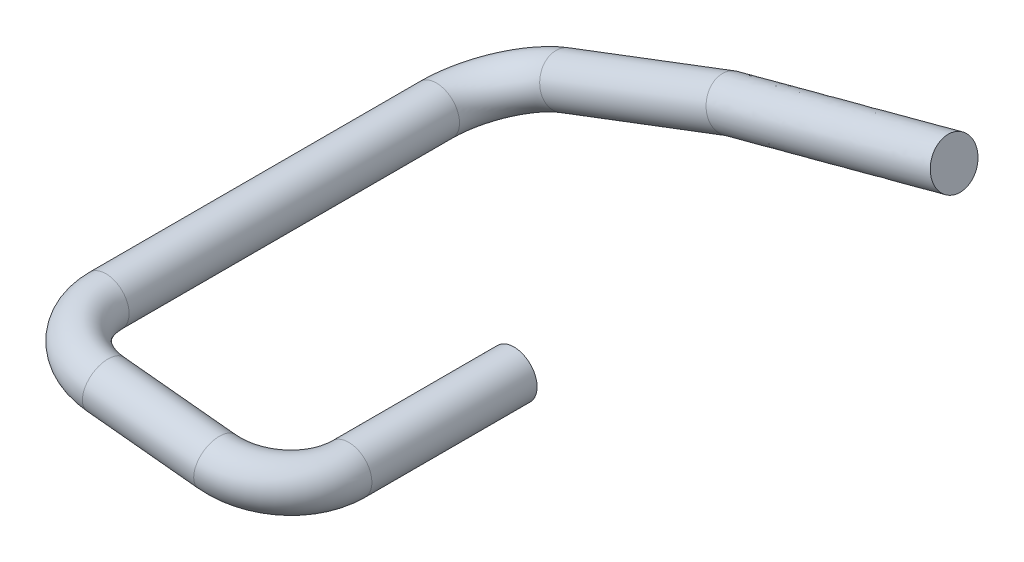
ISO-10303-21;
HEADER;
FILE_DESCRIPTION(('STEP AP214'),'2;1');
FILE_NAME('part.step','',(''),(''),'','','');
FILE_SCHEMA(('AUTOMOTIVE_DESIGN { 1 0 10303 214 1 1 1 1 }'));
ENDSEC;
DATA;
#1=APPLICATION_CONTEXT('core data for automotive mechanical design processes');
#2=APPLICATION_PROTOCOL_DEFINITION('international standard','automotive_design',2000,#1);
#3=PRODUCT_CONTEXT('',#1,'mechanical');
#4=PRODUCT('Part','Part','',(#3));
#5=PRODUCT_RELATED_PRODUCT_CATEGORY('part','',(#4));
#6=PRODUCT_DEFINITION_FORMATION('','',#4);
#7=PRODUCT_DEFINITION_CONTEXT('part definition',#1,'design');
#8=PRODUCT_DEFINITION('design','',#6,#7);
#9=PRODUCT_DEFINITION_SHAPE('','',#8);
#10=(LENGTH_UNIT() NAMED_UNIT(*) SI_UNIT(.MILLI.,.METRE.));
#11=(NAMED_UNIT(*) PLANE_ANGLE_UNIT() SI_UNIT($,.RADIAN.));
#12=(NAMED_UNIT(*) SI_UNIT($,.STERADIAN.) SOLID_ANGLE_UNIT());
#13=UNCERTAINTY_MEASURE_WITH_UNIT(LENGTH_MEASURE(1.E-05),#10,'distance_accuracy_value','');
#14=(GEOMETRIC_REPRESENTATION_CONTEXT(3) GLOBAL_UNCERTAINTY_ASSIGNED_CONTEXT((#13)) GLOBAL_UNIT_ASSIGNED_CONTEXT((#10,
#11,#12)) REPRESENTATION_CONTEXT('',''));
#15=CARTESIAN_POINT('',(0.,0.,0.));
#16=DIRECTION('',(0.,0.,1.));
#17=DIRECTION('',(1.,0.,0.));
#18=AXIS2_PLACEMENT_3D('',#15,#16,#17);
#19=CARTESIAN_POINT('',(6.5,0.,0.));
#20=DIRECTION('',(0.,0.,-1.));
#21=DIRECTION('',(0.,-1.,0.));
#22=AXIS2_PLACEMENT_3D('',#19,#20,#21);
#23=PLANE('',#22);
#24=CARTESIAN_POINT('',(6.5,0.,0.));
#25=DIRECTION('',(0.,0.,-1.));
#26=DIRECTION('',(-0.97970833772415,0.200428473510582,0.));
#27=AXIS2_PLACEMENT_3D('',#24,#25,#26);
#28=CIRCLE('',#27,0.35);
#29=CARTESIAN_POINT('',(6.84289791820345,-0.070149965728704,0.));
#30=VERTEX_POINT('',#29);
#31=EDGE_CURVE('E136',#30,#30,#28,.T.);
#32=ORIENTED_EDGE('',*,*,#31,.T.);
#33=EDGE_LOOP('',(#32));
#34=FACE_BOUND('',#33,.T.);
#35=ADVANCED_FACE('F17',(#34),#23,.T.);
#36=CARTESIAN_POINT('',(2.82561785491536,0.371999647827147,0.));
#37=DIRECTION('',(0.,0.,1.));
#38=DIRECTION('',(1.,0.,0.));
#39=AXIS2_PLACEMENT_3D('',#36,#37,#38);
#40=CYLINDRICAL_SURFACE('',#39,0.35);
#41=CARTESIAN_POINT('',(2.82561785491536,0.371999647827147,2.5));
#42=DIRECTION('',(0.,0.,1.));
#43=DIRECTION('',(1.,0.,0.));
#44=AXIS2_PLACEMENT_3D('',#41,#42,#43);
#45=CIRCLE('',#44,0.35);
#46=CARTESIAN_POINT('',(2.47561785491536,0.371999647827147,2.5));
#47=VERTEX_POINT('',#46);
#48=CARTESIAN_POINT('',(3.17383780794161,0.33674536703182,2.5));
#49=VERTEX_POINT('',#48);
#50=EDGE_CURVE('E25',#47,#49,#45,.T.);
#51=ORIENTED_EDGE('',*,*,#50,.F.);
#52=DIRECTION('',(0.,0.,-1.));
#53=VECTOR('',#52,1.);
#54=CARTESIAN_POINT('',(2.47561785491536,0.371999647827147,0.));
#55=LINE('',#54,#53);
#56=CARTESIAN_POINT('',(2.47561785491536,0.371999647827147,-2.5));
#57=VERTEX_POINT('',#56);
#58=EDGE_CURVE('E11',#47,#57,#55,.T.);
#59=ORIENTED_EDGE('',*,*,#58,.T.);
#60=CARTESIAN_POINT('',(2.82561785491536,0.371999647827147,-2.5));
#61=DIRECTION('',(0.,0.,-1.));
#62=DIRECTION('',(1.,0.,0.));
#63=AXIS2_PLACEMENT_3D('',#60,#61,#62);
#64=CIRCLE('',#63,0.35);
#65=CARTESIAN_POINT('',(3.15284802148136,0.496178623862499,-2.5));
#66=VERTEX_POINT('',#65);
#67=EDGE_CURVE('E158',#66,#57,#64,.T.);
#68=ORIENTED_EDGE('',*,*,#67,.F.);
#69=CARTESIAN_POINT('',(2.82561785491536,0.371999647827147,-2.5));
#70=DIRECTION('',(0.,0.,-1.));
#71=DIRECTION('',(1.,0.,0.));
#72=AXIS2_PLACEMENT_3D('',#69,#70,#71);
#73=CIRCLE('',#72,0.35);
#74=EDGE_CURVE('E155',#57,#66,#73,.T.);
#75=ORIENTED_EDGE('',*,*,#74,.F.);
#76=ORIENTED_EDGE('',*,*,#58,.F.);
#77=CARTESIAN_POINT('',(2.82561785491536,0.371999647827147,2.5));
#78=DIRECTION('',(0.,0.,1.));
#79=DIRECTION('',(1.,0.,0.));
#80=AXIS2_PLACEMENT_3D('',#77,#78,#79);
#81=CIRCLE('',#80,0.35);
#82=EDGE_CURVE('E142',#49,#47,#81,.T.);
#83=ORIENTED_EDGE('',*,*,#82,.F.);
#84=EDGE_LOOP('',(#51,#59,#68,#75,#76,#83));
#85=FACE_BOUND('',#84,.T.);
#86=ADVANCED_FACE('F284',(#85),#40,.T.);
#87=CARTESIAN_POINT('',(3.82053200641893,0.271273131269069,2.5));
#88=DIRECTION('',(0.100726516558078,0.994914151503573,0.));
#89=DIRECTION('',(0.,0.,1.));
#90=AXIS2_PLACEMENT_3D('',#87,#88,#89);
#91=TOROIDAL_SURFACE('',#90,1.,0.35);
#92=CARTESIAN_POINT('',(3.82053200641893,0.271273131269069,3.5));
#93=DIRECTION('',(0.994914151503573,-0.100726516558078,0.));
#94=DIRECTION('',(0.0101458311379248,0.100214236755291,-0.994914151503573));
#95=AXIS2_PLACEMENT_3D('',#92,#93,#94);
#96=CIRCLE('',#95,0.35);
#97=CARTESIAN_POINT('',(3.81698096552066,0.236198148404717,3.84821995302625));
#98=VERTEX_POINT('',#97);
#99=CARTESIAN_POINT('',(3.82053200641893,0.271273131269069,3.15));
#100=VERTEX_POINT('',#99);
#101=EDGE_CURVE('E148',#98,#100,#96,.T.);
#102=ORIENTED_EDGE('',*,*,#101,.F.);
#103=CARTESIAN_POINT('',(3.82053200641893,0.271273131269069,3.5));
#104=DIRECTION('',(0.994914151503573,-0.100726516558078,0.));
#105=DIRECTION('',(0.0101458311379248,0.100214236755291,-0.994914151503573));
#106=AXIS2_PLACEMENT_3D('',#103,#104,#105);
#107=CIRCLE('',#106,0.35);
#108=EDGE_CURVE('E143',#100,#98,#107,.T.);
#109=ORIENTED_EDGE('',*,*,#108,.F.);
#110=CARTESIAN_POINT('',(3.82053200641893,0.271273131269069,2.5));
#111=DIRECTION('',(-0.100726516558078,-0.994914151503573,0.));
#112=DIRECTION('',(0.,0.,1.));
#113=AXIS2_PLACEMENT_3D('',#110,#111,#112);
#114=CIRCLE('',#113,0.65);
#115=EDGE_CURVE('E138',#100,#49,#114,.T.);
#116=ORIENTED_EDGE('',*,*,#115,.T.);
#117=ORIENTED_EDGE('',*,*,#82,.T.);
#118=ORIENTED_EDGE('',*,*,#50,.T.);
#119=ORIENTED_EDGE('',*,*,#115,.F.);
#120=EDGE_LOOP('',(#102,#109,#116,#117,#118,#119));
#121=FACE_BOUND('',#120,.T.);
#122=ADVANCED_FACE('F286',(#121),#91,.T.);
#123=CARTESIAN_POINT('',(3.82053200641893,0.271273131269069,3.5));
#124=DIRECTION('',(0.994914151503573,-0.100726516558078,0.));
#125=DIRECTION('',(0.0101458311379248,0.100214236755291,-0.994914151503573));
#126=AXIS2_PLACEMENT_3D('',#123,#124,#125);
#127=CYLINDRICAL_SURFACE('',#126,0.35);
#128=CARTESIAN_POINT('',(5.50508584849643,0.100726516558077,3.5));
#129=DIRECTION('',(0.994914151503573,-0.100726516558078,0.));
#130=DIRECTION('',(0.0101458311379248,0.100214236755291,-0.994914151503573));
#131=AXIS2_PLACEMENT_3D('',#128,#129,#130);
#132=CIRCLE('',#131,0.35);
#133=CARTESIAN_POINT('',(5.50153480759815,0.0656515336937261,3.84821995302625));
#134=VERTEX_POINT('',#133);
#135=CARTESIAN_POINT('',(5.50508584849643,0.100726516558077,3.15));
#136=VERTEX_POINT('',#135);
#137=EDGE_CURVE('E149',#134,#136,#132,.T.);
#138=ORIENTED_EDGE('',*,*,#137,.F.);
#139=DIRECTION('',(-0.994914151503573,0.100726516558078,0.));
#140=VECTOR('',#139,1.);
#141=CARTESIAN_POINT('',(3.81698096552066,0.236198148404717,3.84821995302625));
#142=LINE('',#141,#140);
#143=EDGE_CURVE('E144',#134,#98,#142,.T.);
#144=ORIENTED_EDGE('',*,*,#143,.T.);
#145=ORIENTED_EDGE('',*,*,#101,.T.);
#146=ORIENTED_EDGE('',*,*,#108,.T.);
#147=ORIENTED_EDGE('',*,*,#143,.F.);
#148=CARTESIAN_POINT('',(5.50508584849643,0.100726516558077,3.5));
#149=DIRECTION('',(0.994914151503573,-0.100726516558078,0.));
#150=DIRECTION('',(0.0101458311379248,0.100214236755291,-0.994914151503573));
#151=AXIS2_PLACEMENT_3D('',#148,#149,#150);
#152=CIRCLE('',#151,0.35);
#153=EDGE_CURVE('E183',#136,#134,#152,.T.);
#154=ORIENTED_EDGE('',*,*,#153,.F.);
#155=EDGE_LOOP('',(#138,#144,#145,#146,#147,#154));
#156=FACE_BOUND('',#155,.T.);
#157=ADVANCED_FACE('F290',(#156),#127,.T.);
#158=CARTESIAN_POINT('',(5.50508584849643,0.100726516558077,2.5));
#159=DIRECTION('',(0.100726516558078,0.994914151503573,0.));
#160=DIRECTION('',(0.,0.,1.));
#161=AXIS2_PLACEMENT_3D('',#158,#159,#160);
#162=TOROIDAL_SURFACE('',#161,1.,0.35);
#163=CARTESIAN_POINT('',(6.5,0.,2.5));
#164=DIRECTION('',(0.,0.,-1.));
#165=DIRECTION('',(-0.97970833772415,0.200428473510582,0.));
#166=AXIS2_PLACEMENT_3D('',#163,#164,#165);
#167=CIRCLE('',#166,0.35);
#168=CARTESIAN_POINT('',(6.84289791820345,-0.0701499657287039,2.5));
#169=VERTEX_POINT('',#168);
#170=CARTESIAN_POINT('',(6.15178004697375,0.0352542807953265,2.5));
#171=VERTEX_POINT('',#170);
#172=EDGE_CURVE('E135',#169,#171,#167,.T.);
#173=ORIENTED_EDGE('',*,*,#172,.F.);
#174=CARTESIAN_POINT('',(6.5,0.,2.5));
#175=DIRECTION('',(0.,0.,-1.));
#176=DIRECTION('',(-0.97970833772415,0.200428473510582,0.));
#177=AXIS2_PLACEMENT_3D('',#174,#175,#176);
#178=CIRCLE('',#177,0.35);
#179=EDGE_CURVE('E173',#171,#169,#178,.T.);
#180=ORIENTED_EDGE('',*,*,#179,.F.);
#181=CARTESIAN_POINT('',(5.50508584849643,0.100726516558077,2.5));
#182=DIRECTION('',(-0.100726516558078,-0.994914151503573,0.));
#183=DIRECTION('',(0.,0.,1.));
#184=AXIS2_PLACEMENT_3D('',#181,#182,#183);
#185=CIRCLE('',#184,0.65);
#186=EDGE_CURVE('E179',#171,#136,#185,.T.);
#187=ORIENTED_EDGE('',*,*,#186,.T.);
#188=ORIENTED_EDGE('',*,*,#153,.T.);
#189=ORIENTED_EDGE('',*,*,#137,.T.);
#190=ORIENTED_EDGE('',*,*,#186,.F.);
#191=EDGE_LOOP('',(#173,#180,#187,#188,#189,#190));
#192=FACE_BOUND('',#191,.T.);
#193=ADVANCED_FACE('F295',(#192),#162,.T.);
#194=CARTESIAN_POINT('',(6.5,0.,2.5));
#195=DIRECTION('',(0.,0.,-1.));
#196=DIRECTION('',(-0.97970833772415,0.200428473510582,0.));
#197=AXIS2_PLACEMENT_3D('',#194,#195,#196);
#198=CYLINDRICAL_SURFACE('',#197,0.35);
#199=ORIENTED_EDGE('',*,*,#31,.F.);
#200=DIRECTION('',(0.,0.,1.));
#201=VECTOR('',#200,1.);
#202=CARTESIAN_POINT('',(6.84289791820345,-0.0701499657287044,2.5));
#203=LINE('',#202,#201);
#204=EDGE_CURVE('E129',#30,#169,#203,.T.);
#205=ORIENTED_EDGE('',*,*,#204,.T.);
#206=ORIENTED_EDGE('',*,*,#172,.T.);
#207=ORIENTED_EDGE('',*,*,#179,.T.);
#208=ORIENTED_EDGE('',*,*,#204,.F.);
#209=EDGE_LOOP('',(#199,#205,#206,#207,#208));
#210=FACE_BOUND('',#209,.T.);
#211=ADVANCED_FACE('F298',(#210),#198,.T.);
#212=CARTESIAN_POINT('',(3.76056118796107,0.726796722213867,-2.5));
#213=DIRECTION('',(0.35479707438672,-0.934943333045712,0.));
#214=DIRECTION('',(0.,0.,-1.));
#215=AXIS2_PLACEMENT_3D('',#212,#213,#214);
#216=TOROIDAL_SURFACE('',#215,1.,0.35);
#217=CARTESIAN_POINT('',(3.76056118796107,0.726796722213867,-3.5));
#218=DIRECTION('',(0.934943333045711,0.354797074386721,0.));
#219=DIRECTION('',(0.125880963993376,-0.331715159281988,0.934943333045711));
#220=AXIS2_PLACEMENT_3D('',#217,#218,#219);
#221=CIRCLE('',#220,0.35);
#222=CARTESIAN_POINT('',(3.71650285056339,0.842897027962563,-3.827230166566));
#223=VERTEX_POINT('',#222);
#224=CARTESIAN_POINT('',(3.76056118796107,0.726796722213867,-3.15));
#225=VERTEX_POINT('',#224);
#226=EDGE_CURVE('E159',#223,#225,#221,.T.);
#227=ORIENTED_EDGE('',*,*,#226,.F.);
#228=CARTESIAN_POINT('',(3.76056118796107,0.726796722213867,-3.5));
#229=DIRECTION('',(0.934943333045711,0.354797074386721,0.));
#230=DIRECTION('',(0.125880963993376,-0.331715159281988,0.934943333045711));
#231=AXIS2_PLACEMENT_3D('',#228,#229,#230);
#232=CIRCLE('',#231,0.35);
#233=EDGE_CURVE('E163',#225,#223,#232,.T.);
#234=ORIENTED_EDGE('',*,*,#233,.F.);
#235=CARTESIAN_POINT('',(3.76056118796107,0.726796722213867,-2.5));
#236=DIRECTION('',(-0.35479707438672,0.934943333045712,0.));
#237=DIRECTION('',(0.,0.,-1.));
#238=AXIS2_PLACEMENT_3D('',#235,#236,#237);
#239=CIRCLE('',#238,0.65);
#240=EDGE_CURVE('E166',#225,#66,#239,.T.);
#241=ORIENTED_EDGE('',*,*,#240,.T.);
#242=ORIENTED_EDGE('',*,*,#67,.T.);
#243=ORIENTED_EDGE('',*,*,#74,.T.);
#244=ORIENTED_EDGE('',*,*,#240,.F.);
#245=EDGE_LOOP('',(#227,#234,#241,#242,#243,#244));
#246=FACE_BOUND('',#245,.T.);
#247=ADVANCED_FACE('F282',(#246),#216,.T.);
#248=CARTESIAN_POINT('',(3.76056118796107,0.726796722213867,-3.5));
#249=DIRECTION('',(0.934943333045712,0.35479707438672,0.));
#250=DIRECTION('',(0.125880963993376,-0.331715159281988,0.934943333045711));
#251=AXIS2_PLACEMENT_3D('',#248,#249,#250);
#252=CYLINDRICAL_SURFACE('',#251,0.35);
#253=CARTESIAN_POINT('',(6.27851787087895,1.68232379316638,-3.5));
#254=DIRECTION('',(0.934943333045711,0.354797074386721,0.));
#255=DIRECTION('',(0.125880963993376,-0.331715159281988,0.934943333045711));
#256=AXIS2_PLACEMENT_3D('',#253,#254,#255);
#257=CIRCLE('',#256,0.35);
#258=CARTESIAN_POINT('',(6.27851787087895,1.68232379316638,-3.85));
#259=VERTEX_POINT('',#258);
#260=CARTESIAN_POINT('',(6.23445953348127,1.79842409891508,-3.827230166566));
#261=VERTEX_POINT('',#260);
#262=EDGE_CURVE('E122',#259,#261,#257,.T.);
#263=ORIENTED_EDGE('',*,*,#262,.F.);
#264=CARTESIAN_POINT('',(6.27851787087895,1.68232379316638,-3.5));
#265=DIRECTION('',(0.934943333045711,0.354797074386721,0.));
#266=DIRECTION('',(0.125880963993376,-0.331715159281988,0.934943333045711));
#267=AXIS2_PLACEMENT_3D('',#264,#265,#266);
#268=CIRCLE('',#267,0.35);
#269=CARTESIAN_POINT('',(6.27851787087895,1.68232379316638,-3.15));
#270=VERTEX_POINT('',#269);
#271=EDGE_CURVE('E115',#270,#259,#268,.T.);
#272=ORIENTED_EDGE('',*,*,#271,.F.);
#273=CARTESIAN_POINT('',(6.27851787087895,1.68232379316638,-3.5));
#274=DIRECTION('',(0.934943333045711,0.354797074386721,0.));
#275=DIRECTION('',(0.125880963993376,-0.331715159281988,0.934943333045711));
#276=AXIS2_PLACEMENT_3D('',#273,#274,#275);
#277=CIRCLE('',#276,0.35);
#278=EDGE_CURVE('E111',#261,#270,#277,.T.);
#279=ORIENTED_EDGE('',*,*,#278,.F.);
#280=DIRECTION('',(-0.934943333045712,-0.35479707438672,0.));
#281=VECTOR('',#280,1.);
#282=CARTESIAN_POINT('',(3.71650285056339,0.842897027962563,-3.827230166566));
#283=LINE('',#282,#281);
#284=EDGE_CURVE('E154',#261,#223,#283,.T.);
#285=ORIENTED_EDGE('',*,*,#284,.T.);
#286=ORIENTED_EDGE('',*,*,#226,.T.);
#287=ORIENTED_EDGE('',*,*,#233,.T.);
#288=ORIENTED_EDGE('',*,*,#284,.F.);
#289=EDGE_LOOP('',(#263,#272,#279,#285,#286,#287,#288));
#290=FACE_BOUND('',#289,.T.);
#291=ADVANCED_FACE('F278',(#290),#252,.T.);
#292=CARTESIAN_POINT('',(6.23669411816194,1.67114378790097,-3.15));
#293=CARTESIAN_POINT('',(6.32661474119793,1.33475594078179,-3.14999999999999));
#294=CARTESIAN_POINT('',(6.32661474119793,1.33475594078178,-3.5));
#295=CARTESIAN_POINT('',(6.32661474119793,1.33475594078178,-3.84999999999999));
#296=CARTESIAN_POINT('',(6.23669411816194,1.67114378790095,-3.85));
#297=CARTESIAN_POINT('',(6.14677349512595,2.00753163502013,-3.85000000000001));
#298=CARTESIAN_POINT('',(6.14677349512595,2.00753163502014,-3.5));
#299=CARTESIAN_POINT('',(6.14677349512595,2.00753163502015,-3.15000000000001));
#300=CARTESIAN_POINT('',(6.23669411816194,1.67114378790097,-3.15));
#301=CARTESIAN_POINT('',(9.66076169643821,2.58643930940313,-3.15));
#302=CARTESIAN_POINT('',(9.75068231947421,2.25005146228395,-3.14999999999999));
#303=CARTESIAN_POINT('',(9.75068231947421,2.25005146228394,-3.5));
#304=CARTESIAN_POINT('',(9.75068231947421,2.25005146228393,-3.84999999999999));
#305=CARTESIAN_POINT('',(9.66076169643822,2.58643930940311,-3.85));
#306=CARTESIAN_POINT('',(9.57084107340223,2.92282715652229,-3.85000000000001));
#307=CARTESIAN_POINT('',(9.57084107340223,2.9228271565223,-3.5));
#308=CARTESIAN_POINT('',(9.57084107340222,2.92282715652231,-3.15000000000001));
#309=CARTESIAN_POINT('',(9.66076169643821,2.58643930940313,-3.15));
#310=(BOUNDED_SURFACE() B_SPLINE_SURFACE(1,2,((#292,#293,#294,#295,#296,#297,#298,#299,#300),
(#301,#302,#303,#304,#305,#306,#307,#308,#309)),.UNSPECIFIED.,.F.,.T.,
.F.) B_SPLINE_SURFACE_WITH_KNOTS((2,2),(3,2,2,2,3),(-0.123692139524501,10.002855984916),
(-3.14159265358979,-1.5707963267949,0.,1.5707963267949,3.14159265358979),
.UNSPECIFIED.) GEOMETRIC_REPRESENTATION_ITEM() RATIONAL_B_SPLINE_SURFACE(((1.,0.707106781186548,
1.,0.707106781186548,1.,0.707106781186548,1.,0.707106781186548,1.),(1.,0.707106781186548,1.,
0.707106781186548,1.,0.707106781186548,1.,0.707106781186548,1.))) REPRESENTATION_ITEM('') SURFACE());
#311=CARTESIAN_POINT('',(9.66076169643822,2.58643930940312,-3.5));
#312=DIRECTION('',(-0.966079467892423,-0.258244964552442,0.));
#313=DIRECTION('',(0.,0.,-1.));
#314=AXIS2_PLACEMENT_3D('',#311,#312,#313);
#315=ELLIPSE('',#314,0.35,0.348198940458837);
#316=CARTESIAN_POINT('',(9.66076169643821,2.58643930940313,-3.15));
#317=VERTEX_POINT('',#316);
#318=EDGE_CURVE('E108',#317,#317,#315,.T.);
#319=CARTESIAN_POINT('',(9.66076169643821,2.58643930940313,-3.15));
#320=CARTESIAN_POINT('',(6.27851787087894,1.68232379316639,-3.15));
#321=(BOUNDED_CURVE() B_SPLINE_CURVE(1,(#319,#320),.UNSPECIFIED.,.F.,
.F.) B_SPLINE_CURVE_WITH_KNOTS((2,2),(-10.002855984916,0.),
.UNSPECIFIED.) CURVE() GEOMETRIC_REPRESENTATION_ITEM() RATIONAL_B_SPLINE_CURVE((1.,1.)) REPRESENTATION_ITEM(''));
#322=EDGE_CURVE('E105',#317,#270,#321,.T.);
#323=ORIENTED_EDGE('',*,*,#318,.T.);
#324=ORIENTED_EDGE('',*,*,#322,.T.);
#325=ORIENTED_EDGE('',*,*,#271,.T.);
#326=ORIENTED_EDGE('',*,*,#262,.T.);
#327=ORIENTED_EDGE('',*,*,#278,.T.);
#328=ORIENTED_EDGE('',*,*,#322,.F.);
#329=EDGE_LOOP('',(#323,#324,#325,#326,#327,#328));
#330=FACE_BOUND('',#329,.T.);
#331=ADVANCED_FACE('F106',(#330),#310,.F.);
#332=CARTESIAN_POINT('',(9.53167313141475,3.06935216086955,-3.5));
#333=DIRECTION('',(-0.966079467892423,-0.258244964552442,0.));
#334=DIRECTION('',(-0.258244964552442,0.966079467892423,0.));
#335=AXIS2_PLACEMENT_3D('',#332,#333,#334);
#336=PLANE('',#335);
#337=ORIENTED_EDGE('',*,*,#318,.F.);
#338=EDGE_LOOP('',(#337));
#339=FACE_BOUND('',#338,.T.);
#340=ADVANCED_FACE('F322',(#339),#336,.F.);
#341=CLOSED_SHELL('',(#35,#86,#122,#157,#193,#211,#247,#291,#331,#340));
#342=MANIFOLD_SOLID_BREP('B1',#341);
#343=ADVANCED_BREP_SHAPE_REPRESENTATION('',(#18,#342),#14);
#344=SHAPE_DEFINITION_REPRESENTATION(#9,#343);
ENDSEC;
END-ISO-10303-21;
